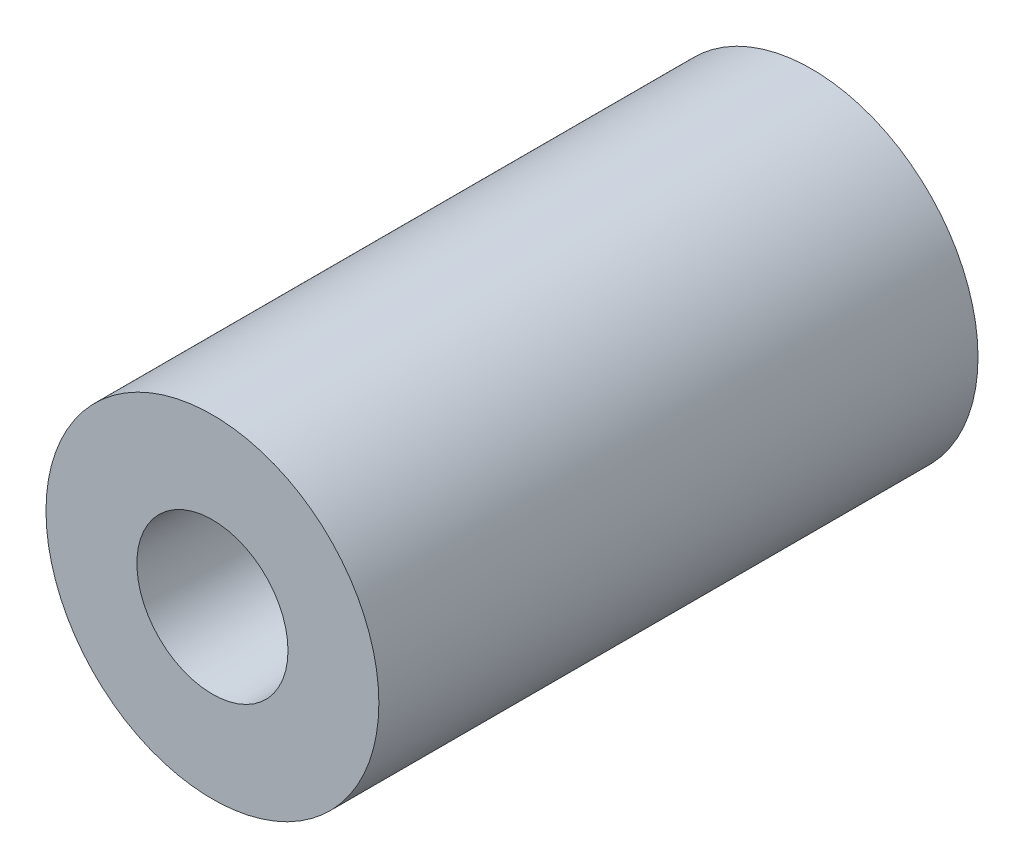
ISO-10303-21;
HEADER;
FILE_DESCRIPTION(('STEP AP214'),'2;1');
FILE_NAME('part.step','',(''),(''),'','','');
FILE_SCHEMA(('AUTOMOTIVE_DESIGN { 1 0 10303 214 1 1 1 1 }'));
ENDSEC;
DATA;
#1=APPLICATION_CONTEXT('core data for automotive mechanical design processes');
#2=APPLICATION_PROTOCOL_DEFINITION('international standard','automotive_design',2000,#1);
#3=PRODUCT_CONTEXT('',#1,'mechanical');
#4=PRODUCT('Part','Part','',(#3));
#5=PRODUCT_RELATED_PRODUCT_CATEGORY('part','',(#4));
#6=PRODUCT_DEFINITION_FORMATION('','',#4);
#7=PRODUCT_DEFINITION_CONTEXT('part definition',#1,'design');
#8=PRODUCT_DEFINITION('design','',#6,#7);
#9=PRODUCT_DEFINITION_SHAPE('','',#8);
#10=(LENGTH_UNIT() NAMED_UNIT(*) SI_UNIT(.MILLI.,.METRE.));
#11=(NAMED_UNIT(*) PLANE_ANGLE_UNIT() SI_UNIT($,.RADIAN.));
#12=(NAMED_UNIT(*) SI_UNIT($,.STERADIAN.) SOLID_ANGLE_UNIT());
#13=UNCERTAINTY_MEASURE_WITH_UNIT(LENGTH_MEASURE(1.E-05),#10,'distance_accuracy_value','');
#14=(GEOMETRIC_REPRESENTATION_CONTEXT(3) GLOBAL_UNCERTAINTY_ASSIGNED_CONTEXT((#13)) GLOBAL_UNIT_ASSIGNED_CONTEXT((#10,
#11,#12)) REPRESENTATION_CONTEXT('',''));
#15=CARTESIAN_POINT('',(0.,0.,0.));
#16=DIRECTION('',(0.,0.,1.));
#17=DIRECTION('',(1.,0.,0.));
#18=AXIS2_PLACEMENT_3D('',#15,#16,#17);
#19=CARTESIAN_POINT('',(0.,0.,18.));
#20=DIRECTION('',(0.,0.,-1.));
#21=DIRECTION('',(-1.,0.,0.));
#22=AXIS2_PLACEMENT_3D('',#19,#20,#21);
#23=CYLINDRICAL_SURFACE('',#22,1.);
#24=CARTESIAN_POINT('',(0.,0.,5.68));
#25=DIRECTION('',(0.,0.,1.));
#26=DIRECTION('',(1.,0.,0.));
#27=AXIS2_PLACEMENT_3D('',#24,#25,#26);
#28=CIRCLE('',#27,1.);
#29=CARTESIAN_POINT('',(1.,0.,5.68));
#30=VERTEX_POINT('',#29);
#31=EDGE_CURVE('E52',#30,#30,#28,.F.);
#32=ORIENTED_EDGE('',*,*,#31,.T.);
#33=EDGE_LOOP('',(#32));
#34=FACE_BOUND('',#33,.T.);
#35=CARTESIAN_POINT('',(0.,0.,12.32));
#36=DIRECTION('',(0.,0.,1.));
#37=DIRECTION('',(1.,0.,0.));
#38=AXIS2_PLACEMENT_3D('',#35,#36,#37);
#39=CIRCLE('',#38,1.);
#40=CARTESIAN_POINT('',(1.,0.,12.32));
#41=VERTEX_POINT('',#40);
#42=EDGE_CURVE('E39',#41,#41,#39,.T.);
#43=ORIENTED_EDGE('',*,*,#42,.T.);
#44=EDGE_LOOP('',(#43));
#45=FACE_BOUND('',#44,.T.);
#46=ADVANCED_FACE('F35',(#34,#45),#23,.F.);
#47=CARTESIAN_POINT('',(0.,0.,18.));
#48=DIRECTION('',(0.,0.,-1.));
#49=DIRECTION('',(-1.,0.,0.));
#50=AXIS2_PLACEMENT_3D('',#47,#48,#49);
#51=CYLINDRICAL_SURFACE('',#50,5.);
#52=CARTESIAN_POINT('',(0.,0.,18.));
#53=DIRECTION('',(0.,0.,1.));
#54=DIRECTION('',(1.,0.,0.));
#55=AXIS2_PLACEMENT_3D('',#52,#53,#54);
#56=CIRCLE('',#55,5.);
#57=CARTESIAN_POINT('',(5.,0.,18.));
#58=VERTEX_POINT('',#57);
#59=EDGE_CURVE('E10',#58,#58,#56,.T.);
#60=ORIENTED_EDGE('',*,*,#59,.F.);
#61=EDGE_LOOP('',(#60));
#62=FACE_BOUND('',#61,.T.);
#63=CARTESIAN_POINT('',(0.,0.,0.));
#64=DIRECTION('',(0.,0.,1.));
#65=DIRECTION('',(1.,0.,0.));
#66=AXIS2_PLACEMENT_3D('',#63,#64,#65);
#67=CIRCLE('',#66,5.);
#68=CARTESIAN_POINT('',(5.,0.,0.));
#69=VERTEX_POINT('',#68);
#70=EDGE_CURVE('E43',#69,#69,#67,.T.);
#71=ORIENTED_EDGE('',*,*,#70,.T.);
#72=EDGE_LOOP('',(#71));
#73=FACE_BOUND('',#72,.T.);
#74=ADVANCED_FACE('F37',(#62,#73),#51,.T.);
#75=CARTESIAN_POINT('',(0.,0.,18.));
#76=DIRECTION('',(0.,0.,1.));
#77=DIRECTION('',(1.,0.,0.));
#78=AXIS2_PLACEMENT_3D('',#75,#76,#77);
#79=PLANE('',#78);
#80=CARTESIAN_POINT('',(0.,0.,18.));
#81=DIRECTION('',(0.,0.,1.));
#82=DIRECTION('',(1.,0.,0.));
#83=AXIS2_PLACEMENT_3D('',#80,#81,#82);
#84=CIRCLE('',#83,2.27);
#85=CARTESIAN_POINT('',(2.27,0.,18.));
#86=VERTEX_POINT('',#85);
#87=EDGE_CURVE('E63',#86,#86,#84,.T.);
#88=ORIENTED_EDGE('',*,*,#87,.F.);
#89=EDGE_LOOP('',(#88));
#90=FACE_BOUND('',#89,.T.);
#91=ORIENTED_EDGE('',*,*,#59,.T.);
#92=EDGE_LOOP('',(#91));
#93=FACE_BOUND('',#92,.T.);
#94=ADVANCED_FACE('F73',(#90,#93),#79,.T.);
#95=CARTESIAN_POINT('',(0.,0.,0.));
#96=DIRECTION('',(0.,0.,1.));
#97=DIRECTION('',(1.,0.,0.));
#98=AXIS2_PLACEMENT_3D('',#95,#96,#97);
#99=PLANE('',#98);
#100=CARTESIAN_POINT('',(0.,0.,0.));
#101=DIRECTION('',(0.,0.,1.));
#102=DIRECTION('',(1.,0.,0.));
#103=AXIS2_PLACEMENT_3D('',#100,#101,#102);
#104=CIRCLE('',#103,2.27);
#105=CARTESIAN_POINT('',(2.27,0.,0.));
#106=VERTEX_POINT('',#105);
#107=EDGE_CURVE('E54',#106,#106,#104,.T.);
#108=ORIENTED_EDGE('',*,*,#107,.T.);
#109=EDGE_LOOP('',(#108));
#110=FACE_BOUND('',#109,.T.);
#111=ORIENTED_EDGE('',*,*,#70,.F.);
#112=EDGE_LOOP('',(#111));
#113=FACE_BOUND('',#112,.T.);
#114=ADVANCED_FACE('F75',(#110,#113),#99,.F.);
#115=CARTESIAN_POINT('',(0.,0.,0.));
#116=DIRECTION('',(0.,0.,-1.));
#117=DIRECTION('',(1.,0.,0.));
#118=AXIS2_PLACEMENT_3D('',#115,#116,#117);
#119=CONICAL_SURFACE('',#118,2.27,0.0536514212063058);
#120=CARTESIAN_POINT('',(0.,0.,5.68));
#121=DIRECTION('',(0.,0.,1.));
#122=DIRECTION('',(1.,0.,0.));
#123=AXIS2_PLACEMENT_3D('',#120,#121,#122);
#124=CIRCLE('',#123,1.9649671949344);
#125=CARTESIAN_POINT('',(1.9649671949344,0.,5.68));
#126=VERTEX_POINT('',#125);
#127=EDGE_CURVE('E48',#126,#126,#124,.T.);
#128=ORIENTED_EDGE('',*,*,#127,.T.);
#129=EDGE_LOOP('',(#128));
#130=FACE_BOUND('',#129,.T.);
#131=ORIENTED_EDGE('',*,*,#107,.F.);
#132=EDGE_LOOP('',(#131));
#133=FACE_BOUND('',#132,.T.);
#134=ADVANCED_FACE('F81',(#130,#133),#119,.F.);
#135=CARTESIAN_POINT('',(0.,0.,5.68));
#136=DIRECTION('',(0.,0.,1.));
#137=DIRECTION('',(1.,0.,0.));
#138=AXIS2_PLACEMENT_3D('',#135,#136,#137);
#139=PLANE('',#138);
#140=ORIENTED_EDGE('',*,*,#31,.F.);
#141=EDGE_LOOP('',(#140));
#142=FACE_BOUND('',#141,.T.);
#143=ORIENTED_EDGE('',*,*,#127,.F.);
#144=EDGE_LOOP('',(#143));
#145=FACE_BOUND('',#144,.T.);
#146=ADVANCED_FACE('F92',(#142,#145),#139,.F.);
#147=CARTESIAN_POINT('',(0.,0.,18.));
#148=DIRECTION('',(0.,0.,1.));
#149=DIRECTION('',(1.,0.,0.));
#150=AXIS2_PLACEMENT_3D('',#147,#148,#149);
#151=CONICAL_SURFACE('',#150,2.27,0.0536514212063058);
#152=CARTESIAN_POINT('',(0.,0.,12.32));
#153=DIRECTION('',(0.,0.,1.));
#154=DIRECTION('',(1.,0.,0.));
#155=AXIS2_PLACEMENT_3D('',#152,#153,#154);
#156=CIRCLE('',#155,1.9649671949344);
#157=CARTESIAN_POINT('',(1.9649671949344,0.,12.32));
#158=VERTEX_POINT('',#157);
#159=EDGE_CURVE('E59',#158,#158,#156,.T.);
#160=ORIENTED_EDGE('',*,*,#159,.F.);
#161=EDGE_LOOP('',(#160));
#162=FACE_BOUND('',#161,.T.);
#163=ORIENTED_EDGE('',*,*,#87,.T.);
#164=EDGE_LOOP('',(#163));
#165=FACE_BOUND('',#164,.T.);
#166=ADVANCED_FACE('F71',(#162,#165),#151,.F.);
#167=CARTESIAN_POINT('',(0.,0.,12.32));
#168=DIRECTION('',(0.,0.,1.));
#169=DIRECTION('',(1.,0.,0.));
#170=AXIS2_PLACEMENT_3D('',#167,#168,#169);
#171=PLANE('',#170);
#172=ORIENTED_EDGE('',*,*,#42,.F.);
#173=EDGE_LOOP('',(#172));
#174=FACE_BOUND('',#173,.T.);
#175=ORIENTED_EDGE('',*,*,#159,.T.);
#176=EDGE_LOOP('',(#175));
#177=FACE_BOUND('',#176,.T.);
#178=ADVANCED_FACE('F119',(#174,#177),#171,.T.);
#179=CLOSED_SHELL('',(#46,#74,#94,#114,#134,#146,#166,#178));
#180=MANIFOLD_SOLID_BREP('B2',#179);
#181=ADVANCED_BREP_SHAPE_REPRESENTATION('',(#18,#180),#14);
#182=SHAPE_DEFINITION_REPRESENTATION(#9,#181);
ENDSEC;
END-ISO-10303-21;
